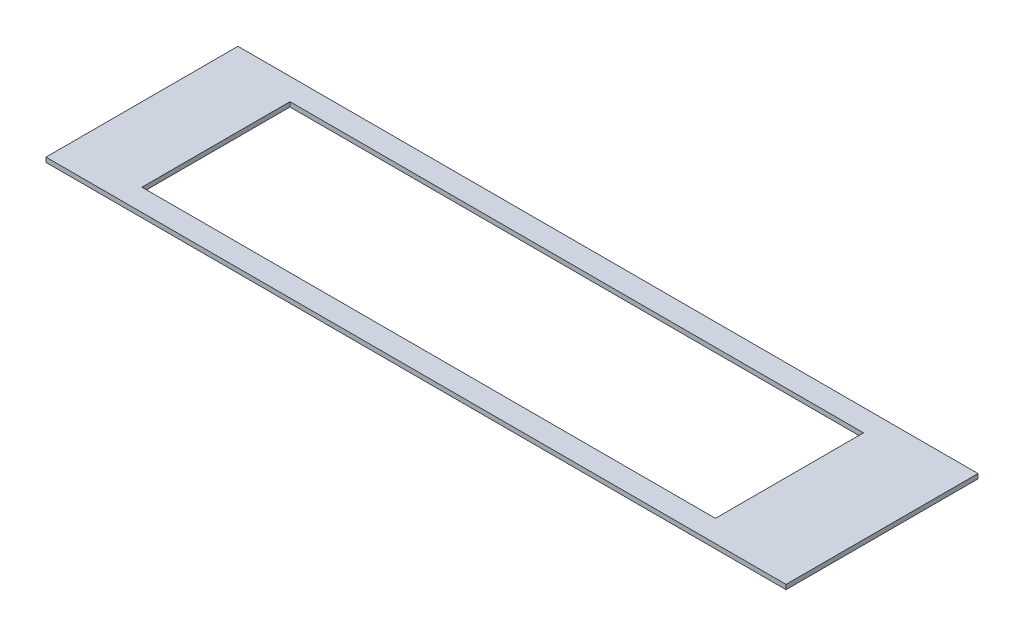
ISO-10303-21;
HEADER;
FILE_DESCRIPTION(('STEP AP214'),'2;1');
FILE_NAME('part.step','',(''),(''),'','','');
FILE_SCHEMA(('AUTOMOTIVE_DESIGN { 1 0 10303 214 1 1 1 1 }'));
ENDSEC;
DATA;
#1=APPLICATION_CONTEXT('core data for automotive mechanical design processes');
#2=APPLICATION_PROTOCOL_DEFINITION('international standard','automotive_design',2000,#1);
#3=PRODUCT_CONTEXT('',#1,'mechanical');
#4=PRODUCT('Part','Part','',(#3));
#5=PRODUCT_RELATED_PRODUCT_CATEGORY('part','',(#4));
#6=PRODUCT_DEFINITION_FORMATION('','',#4);
#7=PRODUCT_DEFINITION_CONTEXT('part definition',#1,'design');
#8=PRODUCT_DEFINITION('design','',#6,#7);
#9=PRODUCT_DEFINITION_SHAPE('','',#8);
#10=(LENGTH_UNIT() NAMED_UNIT(*) SI_UNIT(.MILLI.,.METRE.));
#11=(NAMED_UNIT(*) PLANE_ANGLE_UNIT() SI_UNIT($,.RADIAN.));
#12=(NAMED_UNIT(*) SI_UNIT($,.STERADIAN.) SOLID_ANGLE_UNIT());
#13=UNCERTAINTY_MEASURE_WITH_UNIT(LENGTH_MEASURE(1.E-05),#10,'distance_accuracy_value','');
#14=(GEOMETRIC_REPRESENTATION_CONTEXT(3) GLOBAL_UNCERTAINTY_ASSIGNED_CONTEXT((#13)) GLOBAL_UNIT_ASSIGNED_CONTEXT((#10,
#11,#12)) REPRESENTATION_CONTEXT('',''));
#15=CARTESIAN_POINT('',(0.,0.,0.));
#16=DIRECTION('',(0.,0.,1.));
#17=DIRECTION('',(1.,0.,0.));
#18=AXIS2_PLACEMENT_3D('',#15,#16,#17);
#19=CARTESIAN_POINT('',(0.,3.175,65.884425));
#20=DIRECTION('',(0.,0.,-1.));
#21=DIRECTION('',(-1.,0.,0.));
#22=AXIS2_PLACEMENT_3D('',#19,#20,#21);
#23=PLANE('',#22);
#24=DIRECTION('',(1.,0.,0.));
#25=VECTOR('',#24,1.);
#26=CARTESIAN_POINT('',(0.,0.,65.884425));
#27=LINE('',#26,#25);
#28=CARTESIAN_POINT('',(-254.,0.,65.884425));
#29=VERTEX_POINT('',#28);
#30=CARTESIAN_POINT('',(254.,0.,65.884425));
#31=VERTEX_POINT('',#30);
#32=EDGE_CURVE('E157',#29,#31,#27,.T.);
#33=ORIENTED_EDGE('',*,*,#32,.T.);
#34=DIRECTION('',(0.,-1.,0.));
#35=VECTOR('',#34,1.);
#36=CARTESIAN_POINT('',(254.,3.175,65.884425));
#37=LINE('',#36,#35);
#38=CARTESIAN_POINT('',(254.,3.175,65.884425));
#39=VERTEX_POINT('',#38);
#40=EDGE_CURVE('E11',#39,#31,#37,.T.);
#41=ORIENTED_EDGE('',*,*,#40,.F.);
#42=DIRECTION('',(1.,0.,0.));
#43=VECTOR('',#42,1.);
#44=CARTESIAN_POINT('',(0.,3.175,65.884425));
#45=LINE('',#44,#43);
#46=CARTESIAN_POINT('',(-254.,3.175,65.884425));
#47=VERTEX_POINT('',#46);
#48=EDGE_CURVE('E121',#47,#39,#45,.T.);
#49=ORIENTED_EDGE('',*,*,#48,.F.);
#50=DIRECTION('',(0.,-1.,0.));
#51=VECTOR('',#50,1.);
#52=CARTESIAN_POINT('',(-254.,3.175,65.884425));
#53=LINE('',#52,#51);
#54=EDGE_CURVE('E61',#47,#29,#53,.T.);
#55=ORIENTED_EDGE('',*,*,#54,.T.);
#56=EDGE_LOOP('',(#33,#41,#49,#55));
#57=FACE_BOUND('',#56,.T.);
#58=ADVANCED_FACE('F41',(#57),#23,.F.);
#59=CARTESIAN_POINT('',(254.,3.175,0.));
#60=DIRECTION('',(-1.,0.,0.));
#61=DIRECTION('',(0.,0.,1.));
#62=AXIS2_PLACEMENT_3D('',#59,#60,#61);
#63=PLANE('',#62);
#64=DIRECTION('',(0.,0.,-1.));
#65=VECTOR('',#64,1.);
#66=CARTESIAN_POINT('',(254.,0.,0.));
#67=LINE('',#66,#65);
#68=CARTESIAN_POINT('',(254.,0.,-65.884425));
#69=VERTEX_POINT('',#68);
#70=EDGE_CURVE('E128',#31,#69,#67,.T.);
#71=ORIENTED_EDGE('',*,*,#70,.T.);
#72=DIRECTION('',(0.,-1.,0.));
#73=VECTOR('',#72,1.);
#74=CARTESIAN_POINT('',(254.,3.175,-65.884425));
#75=LINE('',#74,#73);
#76=CARTESIAN_POINT('',(254.,3.175,-65.884425));
#77=VERTEX_POINT('',#76);
#78=EDGE_CURVE('E52',#77,#69,#75,.T.);
#79=ORIENTED_EDGE('',*,*,#78,.F.);
#80=DIRECTION('',(0.,0.,-1.));
#81=VECTOR('',#80,1.);
#82=CARTESIAN_POINT('',(254.,3.175,0.));
#83=LINE('',#82,#81);
#84=EDGE_CURVE('E115',#39,#77,#83,.T.);
#85=ORIENTED_EDGE('',*,*,#84,.F.);
#86=ORIENTED_EDGE('',*,*,#40,.T.);
#87=EDGE_LOOP('',(#71,#79,#85,#86));
#88=FACE_BOUND('',#87,.T.);
#89=ADVANCED_FACE('F127',(#88),#63,.F.);
#90=CARTESIAN_POINT('',(0.,3.175,-65.884425));
#91=DIRECTION('',(0.,0.,-1.));
#92=DIRECTION('',(-1.,0.,0.));
#93=AXIS2_PLACEMENT_3D('',#90,#91,#92);
#94=PLANE('',#93);
#95=DIRECTION('',(1.,0.,0.));
#96=VECTOR('',#95,1.);
#97=CARTESIAN_POINT('',(0.,0.,-65.884425));
#98=LINE('',#97,#96);
#99=CARTESIAN_POINT('',(-254.,0.,-65.884425));
#100=VERTEX_POINT('',#99);
#101=EDGE_CURVE('E162',#100,#69,#98,.T.);
#102=ORIENTED_EDGE('',*,*,#101,.F.);
#103=DIRECTION('',(0.,-1.,0.));
#104=VECTOR('',#103,1.);
#105=CARTESIAN_POINT('',(-254.,3.175,-65.884425));
#106=LINE('',#105,#104);
#107=CARTESIAN_POINT('',(-254.,3.175,-65.884425));
#108=VERTEX_POINT('',#107);
#109=EDGE_CURVE('E87',#108,#100,#106,.T.);
#110=ORIENTED_EDGE('',*,*,#109,.F.);
#111=DIRECTION('',(1.,0.,0.));
#112=VECTOR('',#111,1.);
#113=CARTESIAN_POINT('',(0.,3.175,-65.884425));
#114=LINE('',#113,#112);
#115=EDGE_CURVE('E120',#108,#77,#114,.T.);
#116=ORIENTED_EDGE('',*,*,#115,.T.);
#117=ORIENTED_EDGE('',*,*,#78,.T.);
#118=EDGE_LOOP('',(#102,#110,#116,#117));
#119=FACE_BOUND('',#118,.T.);
#120=ADVANCED_FACE('F133',(#119),#94,.T.);
#121=CARTESIAN_POINT('',(190.5,3.175,0.));
#122=DIRECTION('',(-1.,0.,0.));
#123=DIRECTION('',(0.,0.,1.));
#124=AXIS2_PLACEMENT_3D('',#121,#122,#123);
#125=PLANE('',#124);
#126=DIRECTION('',(0.,0.,-1.));
#127=VECTOR('',#126,1.);
#128=CARTESIAN_POINT('',(190.5,0.,0.));
#129=LINE('',#128,#127);
#130=CARTESIAN_POINT('',(190.5,0.,50.8508));
#131=VERTEX_POINT('',#130);
#132=CARTESIAN_POINT('',(190.5,0.,-50.8));
#133=VERTEX_POINT('',#132);
#134=EDGE_CURVE('E142',#131,#133,#129,.T.);
#135=ORIENTED_EDGE('',*,*,#134,.F.);
#136=DIRECTION('',(0.,-1.,0.));
#137=VECTOR('',#136,1.);
#138=CARTESIAN_POINT('',(190.5,3.175,50.8508));
#139=LINE('',#138,#137);
#140=CARTESIAN_POINT('',(190.5,3.175,50.8508));
#141=VERTEX_POINT('',#140);
#142=EDGE_CURVE('E45',#141,#131,#139,.T.);
#143=ORIENTED_EDGE('',*,*,#142,.F.);
#144=DIRECTION('',(0.,0.,-1.));
#145=VECTOR('',#144,1.);
#146=CARTESIAN_POINT('',(190.5,3.175,0.));
#147=LINE('',#146,#145);
#148=CARTESIAN_POINT('',(190.5,3.175,-50.8));
#149=VERTEX_POINT('',#148);
#150=EDGE_CURVE('E169',#141,#149,#147,.T.);
#151=ORIENTED_EDGE('',*,*,#150,.T.);
#152=DIRECTION('',(0.,-1.,0.));
#153=VECTOR('',#152,1.);
#154=CARTESIAN_POINT('',(190.5,3.175,-50.8));
#155=LINE('',#154,#153);
#156=EDGE_CURVE('E138',#149,#133,#155,.T.);
#157=ORIENTED_EDGE('',*,*,#156,.T.);
#158=EDGE_LOOP('',(#135,#143,#151,#157));
#159=FACE_BOUND('',#158,.T.);
#160=ADVANCED_FACE('F43',(#159),#125,.T.);
#161=CARTESIAN_POINT('',(0.,3.175,50.8508));
#162=DIRECTION('',(0.,0.,-1.));
#163=DIRECTION('',(-1.,0.,0.));
#164=AXIS2_PLACEMENT_3D('',#161,#162,#163);
#165=PLANE('',#164);
#166=DIRECTION('',(1.,0.,0.));
#167=VECTOR('',#166,1.);
#168=CARTESIAN_POINT('',(0.,0.,50.8508));
#169=LINE('',#168,#167);
#170=CARTESIAN_POINT('',(-203.2,0.,50.8508));
#171=VERTEX_POINT('',#170);
#172=EDGE_CURVE('E146',#171,#131,#169,.T.);
#173=ORIENTED_EDGE('',*,*,#172,.F.);
#174=DIRECTION('',(0.,-1.,0.));
#175=VECTOR('',#174,1.);
#176=CARTESIAN_POINT('',(-203.2,3.175,50.8508));
#177=LINE('',#176,#175);
#178=CARTESIAN_POINT('',(-203.2,3.175,50.8508));
#179=VERTEX_POINT('',#178);
#180=EDGE_CURVE('E179',#179,#171,#177,.T.);
#181=ORIENTED_EDGE('',*,*,#180,.F.);
#182=DIRECTION('',(1.,0.,0.));
#183=VECTOR('',#182,1.);
#184=CARTESIAN_POINT('',(0.,3.175,50.8508));
#185=LINE('',#184,#183);
#186=EDGE_CURVE('E190',#179,#141,#185,.T.);
#187=ORIENTED_EDGE('',*,*,#186,.T.);
#188=ORIENTED_EDGE('',*,*,#142,.T.);
#189=EDGE_LOOP('',(#173,#181,#187,#188));
#190=FACE_BOUND('',#189,.T.);
#191=ADVANCED_FACE('F188',(#190),#165,.T.);
#192=CARTESIAN_POINT('',(-203.2,3.175,0.));
#193=DIRECTION('',(-1.,0.,0.));
#194=DIRECTION('',(0.,0.,1.));
#195=AXIS2_PLACEMENT_3D('',#192,#193,#194);
#196=PLANE('',#195);
#197=DIRECTION('',(0.,0.,-1.));
#198=VECTOR('',#197,1.);
#199=CARTESIAN_POINT('',(-203.2,0.,0.));
#200=LINE('',#199,#198);
#201=CARTESIAN_POINT('',(-203.2,0.,-50.8));
#202=VERTEX_POINT('',#201);
#203=EDGE_CURVE('E150',#171,#202,#200,.T.);
#204=ORIENTED_EDGE('',*,*,#203,.T.);
#205=DIRECTION('',(0.,-1.,0.));
#206=VECTOR('',#205,1.);
#207=CARTESIAN_POINT('',(-203.2,3.175,-50.8));
#208=LINE('',#207,#206);
#209=CARTESIAN_POINT('',(-203.2,3.175,-50.8));
#210=VERTEX_POINT('',#209);
#211=EDGE_CURVE('E176',#210,#202,#208,.T.);
#212=ORIENTED_EDGE('',*,*,#211,.F.);
#213=DIRECTION('',(0.,0.,-1.));
#214=VECTOR('',#213,1.);
#215=CARTESIAN_POINT('',(-203.2,3.175,0.));
#216=LINE('',#215,#214);
#217=EDGE_CURVE('E204',#179,#210,#216,.T.);
#218=ORIENTED_EDGE('',*,*,#217,.F.);
#219=ORIENTED_EDGE('',*,*,#180,.T.);
#220=EDGE_LOOP('',(#204,#212,#218,#219));
#221=FACE_BOUND('',#220,.T.);
#222=ADVANCED_FACE('F197',(#221),#196,.F.);
#223=CARTESIAN_POINT('',(0.,3.175,-50.8));
#224=DIRECTION('',(0.,0.,-1.));
#225=DIRECTION('',(-1.,0.,0.));
#226=AXIS2_PLACEMENT_3D('',#223,#224,#225);
#227=PLANE('',#226);
#228=DIRECTION('',(1.,0.,0.));
#229=VECTOR('',#228,1.);
#230=CARTESIAN_POINT('',(0.,0.,-50.8));
#231=LINE('',#230,#229);
#232=EDGE_CURVE('E153',#202,#133,#231,.T.);
#233=ORIENTED_EDGE('',*,*,#232,.T.);
#234=ORIENTED_EDGE('',*,*,#156,.F.);
#235=DIRECTION('',(1.,0.,0.));
#236=VECTOR('',#235,1.);
#237=CARTESIAN_POINT('',(0.,3.175,-50.8));
#238=LINE('',#237,#236);
#239=EDGE_CURVE('E201',#210,#149,#238,.T.);
#240=ORIENTED_EDGE('',*,*,#239,.F.);
#241=ORIENTED_EDGE('',*,*,#211,.T.);
#242=EDGE_LOOP('',(#233,#234,#240,#241));
#243=FACE_BOUND('',#242,.T.);
#244=ADVANCED_FACE('F200',(#243),#227,.F.);
#245=CARTESIAN_POINT('',(-254.,3.175,0.));
#246=DIRECTION('',(-1.,0.,0.));
#247=DIRECTION('',(0.,0.,1.));
#248=AXIS2_PLACEMENT_3D('',#245,#246,#247);
#249=PLANE('',#248);
#250=DIRECTION('',(0.,0.,-1.));
#251=VECTOR('',#250,1.);
#252=CARTESIAN_POINT('',(-254.,0.,0.));
#253=LINE('',#252,#251);
#254=EDGE_CURVE('E165',#29,#100,#253,.T.);
#255=ORIENTED_EDGE('',*,*,#254,.F.);
#256=ORIENTED_EDGE('',*,*,#54,.F.);
#257=DIRECTION('',(0.,0.,-1.));
#258=VECTOR('',#257,1.);
#259=CARTESIAN_POINT('',(-254.,3.175,0.));
#260=LINE('',#259,#258);
#261=EDGE_CURVE('E135',#47,#108,#260,.T.);
#262=ORIENTED_EDGE('',*,*,#261,.T.);
#263=ORIENTED_EDGE('',*,*,#109,.T.);
#264=EDGE_LOOP('',(#255,#256,#262,#263));
#265=FACE_BOUND('',#264,.T.);
#266=ADVANCED_FACE('F214',(#265),#249,.T.);
#267=CARTESIAN_POINT('',(0.,3.175,0.));
#268=DIRECTION('',(0.,1.,0.));
#269=DIRECTION('',(0.,0.,1.));
#270=AXIS2_PLACEMENT_3D('',#267,#268,#269);
#271=PLANE('',#270);
#272=ORIENTED_EDGE('',*,*,#150,.F.);
#273=ORIENTED_EDGE('',*,*,#186,.F.);
#274=ORIENTED_EDGE('',*,*,#217,.T.);
#275=ORIENTED_EDGE('',*,*,#239,.T.);
#276=EDGE_LOOP('',(#272,#273,#274,#275));
#277=FACE_BOUND('',#276,.T.);
#278=ORIENTED_EDGE('',*,*,#48,.T.);
#279=ORIENTED_EDGE('',*,*,#84,.T.);
#280=ORIENTED_EDGE('',*,*,#115,.F.);
#281=ORIENTED_EDGE('',*,*,#261,.F.);
#282=EDGE_LOOP('',(#278,#279,#280,#281));
#283=FACE_BOUND('',#282,.T.);
#284=ADVANCED_FACE('F117',(#277,#283),#271,.T.);
#285=CARTESIAN_POINT('',(0.,0.,0.));
#286=DIRECTION('',(0.,1.,0.));
#287=DIRECTION('',(0.,0.,1.));
#288=AXIS2_PLACEMENT_3D('',#285,#286,#287);
#289=PLANE('',#288);
#290=ORIENTED_EDGE('',*,*,#134,.T.);
#291=ORIENTED_EDGE('',*,*,#232,.F.);
#292=ORIENTED_EDGE('',*,*,#203,.F.);
#293=ORIENTED_EDGE('',*,*,#172,.T.);
#294=EDGE_LOOP('',(#290,#291,#292,#293));
#295=FACE_BOUND('',#294,.T.);
#296=ORIENTED_EDGE('',*,*,#32,.F.);
#297=ORIENTED_EDGE('',*,*,#254,.T.);
#298=ORIENTED_EDGE('',*,*,#101,.T.);
#299=ORIENTED_EDGE('',*,*,#70,.F.);
#300=EDGE_LOOP('',(#296,#297,#298,#299));
#301=FACE_BOUND('',#300,.T.);
#302=ADVANCED_FACE('F194',(#295,#301),#289,.F.);
#303=CLOSED_SHELL('',(#58,#89,#120,#160,#191,#222,#244,#266,#284,#302));
#304=MANIFOLD_SOLID_BREP('B2',#303);
#305=ADVANCED_BREP_SHAPE_REPRESENTATION('',(#18,#304),#14);
#306=SHAPE_DEFINITION_REPRESENTATION(#9,#305);
ENDSEC;
END-ISO-10303-21;
